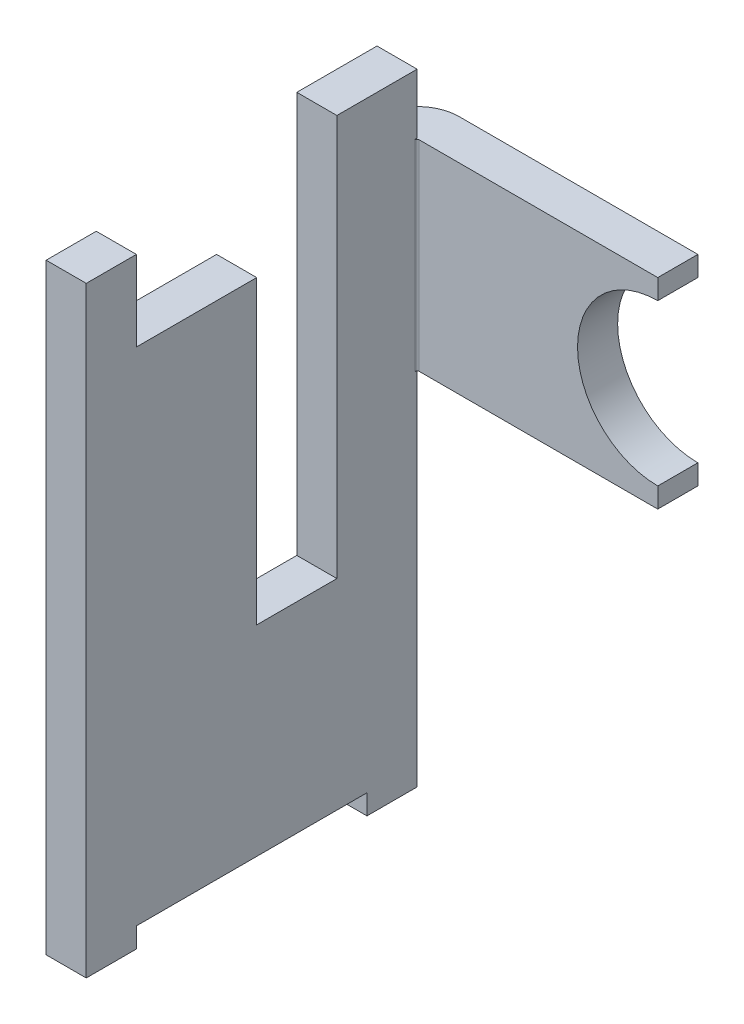
ISO-10303-21;
HEADER;
FILE_DESCRIPTION(('STEP AP214'),'2;1');
FILE_NAME('part.step','',(''),(''),'','','');
FILE_SCHEMA(('AUTOMOTIVE_DESIGN { 1 0 10303 214 1 1 1 1 }'));
ENDSEC;
DATA;
#1=APPLICATION_CONTEXT('core data for automotive mechanical design processes');
#2=APPLICATION_PROTOCOL_DEFINITION('international standard','automotive_design',2000,#1);
#3=PRODUCT_CONTEXT('',#1,'mechanical');
#4=PRODUCT('Part','Part','',(#3));
#5=PRODUCT_RELATED_PRODUCT_CATEGORY('part','',(#4));
#6=PRODUCT_DEFINITION_FORMATION('','',#4);
#7=PRODUCT_DEFINITION_CONTEXT('part definition',#1,'design');
#8=PRODUCT_DEFINITION('design','',#6,#7);
#9=PRODUCT_DEFINITION_SHAPE('','',#8);
#10=(LENGTH_UNIT() NAMED_UNIT(*) SI_UNIT(.MILLI.,.METRE.));
#11=(NAMED_UNIT(*) PLANE_ANGLE_UNIT() SI_UNIT($,.RADIAN.));
#12=(NAMED_UNIT(*) SI_UNIT($,.STERADIAN.) SOLID_ANGLE_UNIT());
#13=UNCERTAINTY_MEASURE_WITH_UNIT(LENGTH_MEASURE(1.E-05),#10,'distance_accuracy_value','');
#14=(GEOMETRIC_REPRESENTATION_CONTEXT(3) GLOBAL_UNCERTAINTY_ASSIGNED_CONTEXT((#13)) GLOBAL_UNIT_ASSIGNED_CONTEXT((#10,
#11,#12)) REPRESENTATION_CONTEXT('',''));
#15=CARTESIAN_POINT('',(0.,0.,0.));
#16=DIRECTION('',(0.,0.,1.));
#17=DIRECTION('',(1.,0.,0.));
#18=AXIS2_PLACEMENT_3D('',#15,#16,#17);
#19=CARTESIAN_POINT('',(1.2,1.25,-1.025));
#20=DIRECTION('',(-1.,0.,0.));
#21=DIRECTION('',(0.,0.,1.));
#22=AXIS2_PLACEMENT_3D('',#19,#20,#21);
#23=PLANE('',#22);
#24=DIRECTION('',(0.,1.,0.));
#25=VECTOR('',#24,1.);
#26=CARTESIAN_POINT('',(1.2,0.,-1.025));
#27=LINE('',#26,#25);
#28=CARTESIAN_POINT('',(1.2,1.25,-1.025));
#29=VERTEX_POINT('',#28);
#30=CARTESIAN_POINT('',(1.2,1.15,-1.025));
#31=VERTEX_POINT('',#30);
#32=EDGE_CURVE('E86',#29,#31,#27,.F.);
#33=ORIENTED_EDGE('',*,*,#32,.F.);
#34=DIRECTION('',(0.,0.,-1.));
#35=VECTOR('',#34,1.);
#36=CARTESIAN_POINT('',(1.2,1.25,-1.025));
#37=LINE('',#36,#35);
#38=CARTESIAN_POINT('',(1.2,1.25,-0.825));
#39=VERTEX_POINT('',#38);
#40=EDGE_CURVE('E123',#29,#39,#37,.F.);
#41=ORIENTED_EDGE('',*,*,#40,.T.);
#42=DIRECTION('',(0.,1.,0.));
#43=VECTOR('',#42,1.);
#44=CARTESIAN_POINT('',(1.2,0.,-0.825));
#45=LINE('',#44,#43);
#46=CARTESIAN_POINT('',(1.2,1.15,-0.825));
#47=VERTEX_POINT('',#46);
#48=EDGE_CURVE('E162',#39,#47,#45,.F.);
#49=ORIENTED_EDGE('',*,*,#48,.T.);
#50=DIRECTION('',(0.,0.,-1.));
#51=VECTOR('',#50,1.);
#52=CARTESIAN_POINT('',(1.2,1.15,-4.69701497931));
#53=LINE('',#52,#51);
#54=EDGE_CURVE('E105',#47,#31,#53,.T.);
#55=ORIENTED_EDGE('',*,*,#54,.T.);
#56=EDGE_LOOP('',(#33,#41,#49,#55));
#57=FACE_BOUND('',#56,.T.);
#58=ADVANCED_FACE('F17',(#57),#23,.F.);
#59=CARTESIAN_POINT('',(1.2,0.75,-4.69701497931));
#60=DIRECTION('',(0.,0.,-1.));
#61=DIRECTION('',(-1.,0.,0.));
#62=AXIS2_PLACEMENT_3D('',#59,#60,#61);
#63=CYLINDRICAL_SURFACE('',#62,0.4);
#64=DIRECTION('',(0.,0.,1.));
#65=VECTOR('',#64,1.);
#66=CARTESIAN_POINT('',(1.2,0.35,-1.025));
#67=LINE('',#66,#65);
#68=CARTESIAN_POINT('',(1.2,0.35,-0.825));
#69=VERTEX_POINT('',#68);
#70=CARTESIAN_POINT('',(1.2,0.35,-1.025));
#71=VERTEX_POINT('',#70);
#72=EDGE_CURVE('E98',#69,#71,#67,.F.);
#73=ORIENTED_EDGE('',*,*,#72,.T.);
#74=CARTESIAN_POINT('',(1.2,0.75,-1.025));
#75=DIRECTION('',(0.,0.,-1.));
#76=DIRECTION('',(-1.,0.,0.));
#77=AXIS2_PLACEMENT_3D('',#74,#75,#76);
#78=CIRCLE('',#77,0.4);
#79=EDGE_CURVE('E20',#31,#71,#78,.F.);
#80=ORIENTED_EDGE('',*,*,#79,.F.);
#81=ORIENTED_EDGE('',*,*,#54,.F.);
#82=CARTESIAN_POINT('',(1.2,0.75,-0.825));
#83=DIRECTION('',(0.,0.,-1.));
#84=DIRECTION('',(-1.,0.,0.));
#85=AXIS2_PLACEMENT_3D('',#82,#83,#84);
#86=CIRCLE('',#85,0.4);
#87=EDGE_CURVE('E101',#47,#69,#86,.F.);
#88=ORIENTED_EDGE('',*,*,#87,.T.);
#89=EDGE_LOOP('',(#73,#80,#81,#88));
#90=FACE_BOUND('',#89,.T.);
#91=ADVANCED_FACE('F99',(#90),#63,.F.);
#92=CARTESIAN_POINT('',(1.2,1.25,-1.025));
#93=DIRECTION('',(-1.,0.,0.));
#94=DIRECTION('',(0.,0.,1.));
#95=AXIS2_PLACEMENT_3D('',#92,#93,#94);
#96=PLANE('',#95);
#97=DIRECTION('',(0.,1.,0.));
#98=VECTOR('',#97,1.);
#99=CARTESIAN_POINT('',(1.2,0.,-0.825));
#100=LINE('',#99,#98);
#101=CARTESIAN_POINT('',(1.2,0.25,-0.825));
#102=VERTEX_POINT('',#101);
#103=EDGE_CURVE('E261',#69,#102,#100,.F.);
#104=ORIENTED_EDGE('',*,*,#103,.T.);
#105=DIRECTION('',(0.,0.,1.));
#106=VECTOR('',#105,1.);
#107=CARTESIAN_POINT('',(1.2,0.25,-1.025));
#108=LINE('',#107,#106);
#109=CARTESIAN_POINT('',(1.2,0.25,-1.025));
#110=VERTEX_POINT('',#109);
#111=EDGE_CURVE('E110',#102,#110,#108,.F.);
#112=ORIENTED_EDGE('',*,*,#111,.T.);
#113=DIRECTION('',(0.,1.,0.));
#114=VECTOR('',#113,1.);
#115=CARTESIAN_POINT('',(1.2,0.,-1.025));
#116=LINE('',#115,#114);
#117=EDGE_CURVE('E94',#71,#110,#116,.F.);
#118=ORIENTED_EDGE('',*,*,#117,.F.);
#119=ORIENTED_EDGE('',*,*,#72,.F.);
#120=EDGE_LOOP('',(#104,#112,#118,#119));
#121=FACE_BOUND('',#120,.T.);
#122=ADVANCED_FACE('F108',(#121),#96,.F.);
#123=CARTESIAN_POINT('',(0.,0.,-1.025));
#124=DIRECTION('',(0.,0.,-1.));
#125=DIRECTION('',(-1.,0.,0.));
#126=AXIS2_PLACEMENT_3D('',#123,#124,#125);
#127=PLANE('',#126);
#128=DIRECTION('',(0.,1.,0.));
#129=VECTOR('',#128,1.);
#130=CARTESIAN_POINT('',(0.01,1.25,-1.025));
#131=LINE('',#130,#129);
#132=CARTESIAN_POINT('',(0.01,1.25,-1.025));
#133=VERTEX_POINT('',#132);
#134=CARTESIAN_POINT('',(0.01,0.25,-1.025));
#135=VERTEX_POINT('',#134);
#136=EDGE_CURVE('E111',#133,#135,#131,.F.);
#137=ORIENTED_EDGE('',*,*,#136,.F.);
#138=DIRECTION('',(1.,0.,0.));
#139=VECTOR('',#138,1.);
#140=CARTESIAN_POINT('',(-0.04969026041821,1.25,-1.025));
#141=LINE('',#140,#139);
#142=EDGE_CURVE('E164',#133,#29,#141,.T.);
#143=ORIENTED_EDGE('',*,*,#142,.T.);
#144=ORIENTED_EDGE('',*,*,#32,.T.);
#145=ORIENTED_EDGE('',*,*,#79,.T.);
#146=ORIENTED_EDGE('',*,*,#117,.T.);
#147=DIRECTION('',(-1.,0.,0.));
#148=VECTOR('',#147,1.);
#149=CARTESIAN_POINT('',(-0.04969026041821,0.25,-1.025));
#150=LINE('',#149,#148);
#151=EDGE_CURVE('E160',#110,#135,#150,.T.);
#152=ORIENTED_EDGE('',*,*,#151,.T.);
#153=EDGE_LOOP('',(#137,#143,#144,#145,#146,#152));
#154=FACE_BOUND('',#153,.T.);
#155=ADVANCED_FACE('F91',(#154),#127,.T.);
#156=CARTESIAN_POINT('',(0.01,1.25,-0.815));
#157=DIRECTION('',(0.,1.,0.));
#158=DIRECTION('',(0.,0.,1.));
#159=AXIS2_PLACEMENT_3D('',#156,#157,#158);
#160=CYLINDRICAL_SURFACE('',#159,0.21);
#161=CARTESIAN_POINT('',(0.01,1.25,-0.815));
#162=DIRECTION('',(0.,1.,0.));
#163=DIRECTION('',(0.,0.,1.));
#164=AXIS2_PLACEMENT_3D('',#161,#162,#163);
#165=CIRCLE('',#164,0.21);
#166=CARTESIAN_POINT('',(-0.2,1.25,-0.815));
#167=VERTEX_POINT('',#166);
#168=EDGE_CURVE('E126',#167,#133,#165,.F.);
#169=ORIENTED_EDGE('',*,*,#168,.T.);
#170=ORIENTED_EDGE('',*,*,#136,.T.);
#171=CARTESIAN_POINT('',(0.01,0.25,-0.815));
#172=DIRECTION('',(0.,1.,0.));
#173=DIRECTION('',(0.,0.,1.));
#174=AXIS2_PLACEMENT_3D('',#171,#172,#173);
#175=CIRCLE('',#174,0.21);
#176=CARTESIAN_POINT('',(-0.2,0.25,-0.815));
#177=VERTEX_POINT('',#176);
#178=EDGE_CURVE('E156',#135,#177,#175,.T.);
#179=ORIENTED_EDGE('',*,*,#178,.T.);
#180=DIRECTION('',(0.,1.,0.));
#181=VECTOR('',#180,1.);
#182=CARTESIAN_POINT('',(-0.2,0.,-0.815));
#183=LINE('',#182,#181);
#184=EDGE_CURVE('E127',#167,#177,#183,.F.);
#185=ORIENTED_EDGE('',*,*,#184,.F.);
#186=EDGE_LOOP('',(#169,#170,#179,#185));
#187=FACE_BOUND('',#186,.T.);
#188=ADVANCED_FACE('F580',(#187),#160,.T.);
#189=CARTESIAN_POINT('',(-0.2,0.,0.));
#190=DIRECTION('',(-1.,0.,0.));
#191=DIRECTION('',(0.,0.,1.));
#192=AXIS2_PLACEMENT_3D('',#189,#190,#191);
#193=PLANE('',#192);
#194=DIRECTION('',(0.,1.,0.));
#195=VECTOR('',#194,1.);
#196=CARTESIAN_POINT('',(-0.2,0.,-0.815));
#197=LINE('',#196,#195);
#198=CARTESIAN_POINT('',(-0.2,1.252,-0.815));
#199=VERTEX_POINT('',#198);
#200=EDGE_CURVE('E130',#199,#167,#197,.F.);
#201=ORIENTED_EDGE('',*,*,#200,.T.);
#202=ORIENTED_EDGE('',*,*,#184,.T.);
#203=DIRECTION('',(0.,1.,0.));
#204=VECTOR('',#203,1.);
#205=CARTESIAN_POINT('',(-0.2,1.252,-0.815));
#206=LINE('',#205,#204);
#207=CARTESIAN_POINT('',(-0.2,0.248,-0.815));
#208=VERTEX_POINT('',#207);
#209=EDGE_CURVE('E113',#177,#208,#206,.F.);
#210=ORIENTED_EDGE('',*,*,#209,.T.);
#211=DIRECTION('',(0.,0.,1.));
#212=VECTOR('',#211,1.);
#213=CARTESIAN_POINT('',(-0.2,0.248,0.));
#214=LINE('',#213,#212);
#215=CARTESIAN_POINT('',(-0.2,0.248,-0.825));
#216=VERTEX_POINT('',#215);
#217=EDGE_CURVE('E165',#208,#216,#214,.F.);
#218=ORIENTED_EDGE('',*,*,#217,.T.);
#219=DIRECTION('',(0.,1.,0.));
#220=VECTOR('',#219,1.);
#221=CARTESIAN_POINT('',(-0.2,1.55,-0.825));
#222=LINE('',#221,#220);
#223=CARTESIAN_POINT('',(-0.2,-1.55,-0.825));
#224=VERTEX_POINT('',#223);
#225=EDGE_CURVE('E394',#216,#224,#222,.F.);
#226=ORIENTED_EDGE('',*,*,#225,.T.);
#227=DIRECTION('',(0.,0.,1.));
#228=VECTOR('',#227,1.);
#229=CARTESIAN_POINT('',(-0.2,-1.55,-0.825));
#230=LINE('',#229,#228);
#231=CARTESIAN_POINT('',(-0.2,-1.55,-0.575));
#232=VERTEX_POINT('',#231);
#233=EDGE_CURVE('E242',#224,#232,#230,.T.);
#234=ORIENTED_EDGE('',*,*,#233,.T.);
#235=DIRECTION('',(0.,1.,0.));
#236=VECTOR('',#235,1.);
#237=CARTESIAN_POINT('',(-0.2,-1.45,-0.575));
#238=LINE('',#237,#236);
#239=CARTESIAN_POINT('',(-0.2,-1.45,-0.575));
#240=VERTEX_POINT('',#239);
#241=EDGE_CURVE('E236',#240,#232,#238,.F.);
#242=ORIENTED_EDGE('',*,*,#241,.F.);
#243=DIRECTION('',(0.,0.,-1.));
#244=VECTOR('',#243,1.);
#245=CARTESIAN_POINT('',(-0.2,-1.45,0.575));
#246=LINE('',#245,#244);
#247=CARTESIAN_POINT('',(-0.2,-1.45,0.575));
#248=VERTEX_POINT('',#247);
#249=EDGE_CURVE('E230',#248,#240,#246,.T.);
#250=ORIENTED_EDGE('',*,*,#249,.F.);
#251=DIRECTION('',(0.,1.,0.));
#252=VECTOR('',#251,1.);
#253=CARTESIAN_POINT('',(-0.2,-1.55,0.575));
#254=LINE('',#253,#252);
#255=CARTESIAN_POINT('',(-0.2,-1.55,0.575));
#256=VERTEX_POINT('',#255);
#257=EDGE_CURVE('E224',#256,#248,#254,.T.);
#258=ORIENTED_EDGE('',*,*,#257,.F.);
#259=DIRECTION('',(0.,0.,1.));
#260=VECTOR('',#259,1.);
#261=CARTESIAN_POINT('',(-0.2,-1.55,-0.825));
#262=LINE('',#261,#260);
#263=CARTESIAN_POINT('',(-0.2,-1.55,0.825));
#264=VERTEX_POINT('',#263);
#265=EDGE_CURVE('E218',#256,#264,#262,.T.);
#266=ORIENTED_EDGE('',*,*,#265,.T.);
#267=DIRECTION('',(0.,1.,0.));
#268=VECTOR('',#267,1.);
#269=CARTESIAN_POINT('',(-0.2,-1.55,0.825));
#270=LINE('',#269,#268);
#271=CARTESIAN_POINT('',(-0.2,1.45,0.825));
#272=VERTEX_POINT('',#271);
#273=EDGE_CURVE('E212',#264,#272,#270,.T.);
#274=ORIENTED_EDGE('',*,*,#273,.T.);
#275=DIRECTION('',(0.,0.,-1.));
#276=VECTOR('',#275,1.);
#277=CARTESIAN_POINT('',(-0.2,1.45,0.825));
#278=LINE('',#277,#276);
#279=CARTESIAN_POINT('',(-0.2,1.45,0.575));
#280=VERTEX_POINT('',#279);
#281=EDGE_CURVE('E206',#272,#280,#278,.T.);
#282=ORIENTED_EDGE('',*,*,#281,.T.);
#283=DIRECTION('',(0.,1.,0.));
#284=VECTOR('',#283,1.);
#285=CARTESIAN_POINT('',(-0.2,1.45,0.575));
#286=LINE('',#285,#284);
#287=CARTESIAN_POINT('',(-0.2,1.05,0.575));
#288=VERTEX_POINT('',#287);
#289=EDGE_CURVE('E200',#280,#288,#286,.F.);
#290=ORIENTED_EDGE('',*,*,#289,.T.);
#291=DIRECTION('',(0.,0.,-1.));
#292=VECTOR('',#291,1.);
#293=CARTESIAN_POINT('',(-0.2,1.05,0.575));
#294=LINE('',#293,#292);
#295=CARTESIAN_POINT('',(-0.2,1.05,-0.025));
#296=VERTEX_POINT('',#295);
#297=EDGE_CURVE('E194',#288,#296,#294,.T.);
#298=ORIENTED_EDGE('',*,*,#297,.T.);
#299=DIRECTION('',(0.,-1.,0.));
#300=VECTOR('',#299,1.);
#301=CARTESIAN_POINT('',(-0.2,1.05,-0.025));
#302=LINE('',#301,#300);
#303=CARTESIAN_POINT('',(-0.2,-0.45,-0.025));
#304=VERTEX_POINT('',#303);
#305=EDGE_CURVE('E188',#296,#304,#302,.T.);
#306=ORIENTED_EDGE('',*,*,#305,.T.);
#307=DIRECTION('',(0.,0.,-1.));
#308=VECTOR('',#307,1.);
#309=CARTESIAN_POINT('',(-0.2,-0.45,-0.025));
#310=LINE('',#309,#308);
#311=CARTESIAN_POINT('',(-0.2,-0.45,-0.425));
#312=VERTEX_POINT('',#311);
#313=EDGE_CURVE('E181',#304,#312,#310,.T.);
#314=ORIENTED_EDGE('',*,*,#313,.T.);
#315=DIRECTION('',(0.,1.,0.));
#316=VECTOR('',#315,1.);
#317=CARTESIAN_POINT('',(-0.2,-0.45,-0.425));
#318=LINE('',#317,#316);
#319=CARTESIAN_POINT('',(-0.2,1.55,-0.425));
#320=VERTEX_POINT('',#319);
#321=EDGE_CURVE('E275',#312,#320,#318,.T.);
#322=ORIENTED_EDGE('',*,*,#321,.T.);
#323=DIRECTION('',(0.,0.,1.));
#324=VECTOR('',#323,1.);
#325=CARTESIAN_POINT('',(-0.2,1.55,0.));
#326=LINE('',#325,#324);
#327=CARTESIAN_POINT('',(-0.2,1.55,-0.825));
#328=VERTEX_POINT('',#327);
#329=EDGE_CURVE('E142',#320,#328,#326,.F.);
#330=ORIENTED_EDGE('',*,*,#329,.T.);
#331=DIRECTION('',(0.,1.,0.));
#332=VECTOR('',#331,1.);
#333=CARTESIAN_POINT('',(-0.2,0.,-0.825));
#334=LINE('',#333,#332);
#335=CARTESIAN_POINT('',(-0.2,1.252,-0.825));
#336=VERTEX_POINT('',#335);
#337=EDGE_CURVE('E137',#328,#336,#334,.F.);
#338=ORIENTED_EDGE('',*,*,#337,.T.);
#339=DIRECTION('',(0.,0.,1.));
#340=VECTOR('',#339,1.);
#341=CARTESIAN_POINT('',(-0.2,1.252,0.));
#342=LINE('',#341,#340);
#343=EDGE_CURVE('E132',#336,#199,#342,.T.);
#344=ORIENTED_EDGE('',*,*,#343,.T.);
#345=EDGE_LOOP('',(#201,#202,#210,#218,#226,#234,#242,#250,#258,#266,#274,#282,#290,#298,#306,
#314,#322,#330,#338,#344));
#346=FACE_BOUND('',#345,.T.);
#347=ADVANCED_FACE('F567',(#346),#193,.T.);
#348=CARTESIAN_POINT('',(-0.04969026041821,1.25,-1.025));
#349=DIRECTION('',(0.,-1.,0.));
#350=DIRECTION('',(0.,0.,-1.));
#351=AXIS2_PLACEMENT_3D('',#348,#349,#350);
#352=PLANE('',#351);
#353=ORIENTED_EDGE('',*,*,#168,.F.);
#354=DIRECTION('',(1.,0.,0.));
#355=VECTOR('',#354,1.);
#356=CARTESIAN_POINT('',(-0.2,1.25,-0.815));
#357=LINE('',#356,#355);
#358=CARTESIAN_POINT('',(0.,1.25,-0.815));
#359=VERTEX_POINT('',#358);
#360=EDGE_CURVE('E155',#167,#359,#357,.T.);
#361=ORIENTED_EDGE('',*,*,#360,.T.);
#362=CARTESIAN_POINT('',(0.01,1.25,-0.815));
#363=DIRECTION('',(0.,1.,0.));
#364=DIRECTION('',(0.,0.,1.));
#365=AXIS2_PLACEMENT_3D('',#362,#363,#364);
#366=CIRCLE('',#365,0.01);
#367=CARTESIAN_POINT('',(0.01,1.25,-0.825));
#368=VERTEX_POINT('',#367);
#369=EDGE_CURVE('E148',#359,#368,#366,.F.);
#370=ORIENTED_EDGE('',*,*,#369,.T.);
#371=DIRECTION('',(-1.,0.,0.));
#372=VECTOR('',#371,1.);
#373=CARTESIAN_POINT('',(0.,1.25,-0.825));
#374=LINE('',#373,#372);
#375=EDGE_CURVE('E258',#368,#39,#374,.F.);
#376=ORIENTED_EDGE('',*,*,#375,.T.);
#377=ORIENTED_EDGE('',*,*,#40,.F.);
#378=ORIENTED_EDGE('',*,*,#142,.F.);
#379=EDGE_LOOP('',(#353,#361,#370,#376,#377,#378));
#380=FACE_BOUND('',#379,.T.);
#381=ADVANCED_FACE('F801',(#380),#352,.F.);
#382=CARTESIAN_POINT('',(0.,0.,-0.825));
#383=DIRECTION('',(0.,0.,-1.));
#384=DIRECTION('',(-1.,0.,0.));
#385=AXIS2_PLACEMENT_3D('',#382,#383,#384);
#386=PLANE('',#385);
#387=ORIENTED_EDGE('',*,*,#48,.F.);
#388=ORIENTED_EDGE('',*,*,#375,.F.);
#389=DIRECTION('',(0.,1.,0.));
#390=VECTOR('',#389,1.);
#391=CARTESIAN_POINT('',(0.01,1.25,-0.825));
#392=LINE('',#391,#390);
#393=CARTESIAN_POINT('',(0.01,0.25,-0.825));
#394=VERTEX_POINT('',#393);
#395=EDGE_CURVE('E151',#368,#394,#392,.F.);
#396=ORIENTED_EDGE('',*,*,#395,.T.);
#397=DIRECTION('',(-1.,0.,0.));
#398=VECTOR('',#397,1.);
#399=CARTESIAN_POINT('',(-0.04969026041821,0.25,-0.825));
#400=LINE('',#399,#398);
#401=EDGE_CURVE('E159',#394,#102,#400,.F.);
#402=ORIENTED_EDGE('',*,*,#401,.T.);
#403=ORIENTED_EDGE('',*,*,#103,.F.);
#404=ORIENTED_EDGE('',*,*,#87,.F.);
#405=EDGE_LOOP('',(#387,#388,#396,#402,#403,#404));
#406=FACE_BOUND('',#405,.T.);
#407=ADVANCED_FACE('F402',(#406),#386,.F.);
#408=CARTESIAN_POINT('',(-0.04969026041821,0.25,-1.025));
#409=DIRECTION('',(0.,1.,0.));
#410=DIRECTION('',(-1.,0.,0.));
#411=AXIS2_PLACEMENT_3D('',#408,#409,#410);
#412=PLANE('',#411);
#413=CARTESIAN_POINT('',(0.01,0.25,-0.815));
#414=DIRECTION('',(0.,1.,0.));
#415=DIRECTION('',(0.,0.,1.));
#416=AXIS2_PLACEMENT_3D('',#413,#414,#415);
#417=CIRCLE('',#416,0.01);
#418=CARTESIAN_POINT('',(0.,0.25,-0.815));
#419=VERTEX_POINT('',#418);
#420=EDGE_CURVE('E152',#394,#419,#417,.T.);
#421=ORIENTED_EDGE('',*,*,#420,.T.);
#422=DIRECTION('',(1.,0.,0.));
#423=VECTOR('',#422,1.);
#424=CARTESIAN_POINT('',(-0.2,0.25,-0.815));
#425=LINE('',#424,#423);
#426=EDGE_CURVE('E270',#419,#177,#425,.F.);
#427=ORIENTED_EDGE('',*,*,#426,.T.);
#428=ORIENTED_EDGE('',*,*,#178,.F.);
#429=ORIENTED_EDGE('',*,*,#151,.F.);
#430=ORIENTED_EDGE('',*,*,#111,.F.);
#431=ORIENTED_EDGE('',*,*,#401,.F.);
#432=EDGE_LOOP('',(#421,#427,#428,#429,#430,#431));
#433=FACE_BOUND('',#432,.T.);
#434=ADVANCED_FACE('F407',(#433),#412,.F.);
#435=CARTESIAN_POINT('',(-0.2,1.55,-0.825));
#436=DIRECTION('',(0.,0.,1.));
#437=DIRECTION('',(1.,0.,0.));
#438=AXIS2_PLACEMENT_3D('',#435,#436,#437);
#439=PLANE('',#438);
#440=DIRECTION('',(1.,0.,0.));
#441=VECTOR('',#440,1.);
#442=CARTESIAN_POINT('',(-0.2,0.248,-0.825));
#443=LINE('',#442,#441);
#444=CARTESIAN_POINT('',(0.,0.248,-0.825));
#445=VERTEX_POINT('',#444);
#446=EDGE_CURVE('E426',#216,#445,#443,.T.);
#447=ORIENTED_EDGE('',*,*,#446,.T.);
#448=DIRECTION('',(0.,1.,0.));
#449=VECTOR('',#448,1.);
#450=CARTESIAN_POINT('',(0.,0.,-0.825));
#451=LINE('',#450,#449);
#452=CARTESIAN_POINT('',(0.,-1.55,-0.825));
#453=VERTEX_POINT('',#452);
#454=EDGE_CURVE('E389',#445,#453,#451,.F.);
#455=ORIENTED_EDGE('',*,*,#454,.T.);
#456=DIRECTION('',(1.,0.,0.));
#457=VECTOR('',#456,1.);
#458=CARTESIAN_POINT('',(-0.2,-1.55,-0.825));
#459=LINE('',#458,#457);
#460=EDGE_CURVE('E245',#453,#224,#459,.F.);
#461=ORIENTED_EDGE('',*,*,#460,.T.);
#462=ORIENTED_EDGE('',*,*,#225,.F.);
#463=EDGE_LOOP('',(#447,#455,#461,#462));
#464=FACE_BOUND('',#463,.T.);
#465=ADVANCED_FACE('F585',(#464),#439,.F.);
#466=CARTESIAN_POINT('',(-0.2,-1.55,-0.825));
#467=DIRECTION('',(0.,1.,0.));
#468=DIRECTION('',(0.,0.,1.));
#469=AXIS2_PLACEMENT_3D('',#466,#467,#468);
#470=PLANE('',#469);
#471=ORIENTED_EDGE('',*,*,#233,.F.);
#472=ORIENTED_EDGE('',*,*,#460,.F.);
#473=DIRECTION('',(0.,0.,1.));
#474=VECTOR('',#473,1.);
#475=CARTESIAN_POINT('',(0.,-1.55,0.));
#476=LINE('',#475,#474);
#477=CARTESIAN_POINT('',(0.,-1.55,-0.575));
#478=VERTEX_POINT('',#477);
#479=EDGE_CURVE('E380',#453,#478,#476,.T.);
#480=ORIENTED_EDGE('',*,*,#479,.T.);
#481=DIRECTION('',(1.,0.,0.));
#482=VECTOR('',#481,1.);
#483=CARTESIAN_POINT('',(-3.517456467392,-1.55,-0.575));
#484=LINE('',#483,#482);
#485=EDGE_CURVE('E239',#232,#478,#484,.T.);
#486=ORIENTED_EDGE('',*,*,#485,.F.);
#487=EDGE_LOOP('',(#471,#472,#480,#486));
#488=FACE_BOUND('',#487,.T.);
#489=ADVANCED_FACE('F589',(#488),#470,.F.);
#490=CARTESIAN_POINT('',(-3.517456467392,-1.45,-0.575));
#491=DIRECTION('',(0.,0.,1.));
#492=DIRECTION('',(1.,0.,0.));
#493=AXIS2_PLACEMENT_3D('',#490,#491,#492);
#494=PLANE('',#493);
#495=DIRECTION('',(1.,0.,0.));
#496=VECTOR('',#495,1.);
#497=CARTESIAN_POINT('',(-3.517456467392,-1.45,-0.575));
#498=LINE('',#497,#496);
#499=CARTESIAN_POINT('',(0.,-1.45,-0.575));
#500=VERTEX_POINT('',#499);
#501=EDGE_CURVE('E233',#240,#500,#498,.T.);
#502=ORIENTED_EDGE('',*,*,#501,.F.);
#503=ORIENTED_EDGE('',*,*,#241,.T.);
#504=ORIENTED_EDGE('',*,*,#485,.T.);
#505=DIRECTION('',(0.,1.,0.));
#506=VECTOR('',#505,1.);
#507=CARTESIAN_POINT('',(0.,0.,-0.575));
#508=LINE('',#507,#506);
#509=EDGE_CURVE('E371',#478,#500,#508,.T.);
#510=ORIENTED_EDGE('',*,*,#509,.T.);
#511=EDGE_LOOP('',(#502,#503,#504,#510));
#512=FACE_BOUND('',#511,.T.);
#513=ADVANCED_FACE('F593',(#512),#494,.T.);
#514=CARTESIAN_POINT('',(-3.517456467392,-1.45,0.575));
#515=DIRECTION('',(0.,-1.,0.));
#516=DIRECTION('',(0.,0.,-1.));
#517=AXIS2_PLACEMENT_3D('',#514,#515,#516);
#518=PLANE('',#517);
#519=DIRECTION('',(-1.,0.,0.));
#520=VECTOR('',#519,1.);
#521=CARTESIAN_POINT('',(-3.517456467392,-1.45,0.575));
#522=LINE('',#521,#520);
#523=CARTESIAN_POINT('',(0.,-1.45,0.575));
#524=VERTEX_POINT('',#523);
#525=EDGE_CURVE('E227',#248,#524,#522,.F.);
#526=ORIENTED_EDGE('',*,*,#525,.F.);
#527=ORIENTED_EDGE('',*,*,#249,.T.);
#528=ORIENTED_EDGE('',*,*,#501,.T.);
#529=DIRECTION('',(0.,0.,1.));
#530=VECTOR('',#529,1.);
#531=CARTESIAN_POINT('',(0.,-1.45,0.));
#532=LINE('',#531,#530);
#533=EDGE_CURVE('E362',#500,#524,#532,.T.);
#534=ORIENTED_EDGE('',*,*,#533,.T.);
#535=EDGE_LOOP('',(#526,#527,#528,#534));
#536=FACE_BOUND('',#535,.T.);
#537=ADVANCED_FACE('F599',(#536),#518,.T.);
#538=CARTESIAN_POINT('',(-3.517456467392,-1.55,0.575));
#539=DIRECTION('',(0.,0.,-1.));
#540=DIRECTION('',(-1.,0.,0.));
#541=AXIS2_PLACEMENT_3D('',#538,#539,#540);
#542=PLANE('',#541);
#543=DIRECTION('',(1.,0.,0.));
#544=VECTOR('',#543,1.);
#545=CARTESIAN_POINT('',(-0.2,-1.55,0.575));
#546=LINE('',#545,#544);
#547=CARTESIAN_POINT('',(0.,-1.55,0.575));
#548=VERTEX_POINT('',#547);
#549=EDGE_CURVE('E221',#548,#256,#546,.F.);
#550=ORIENTED_EDGE('',*,*,#549,.T.);
#551=ORIENTED_EDGE('',*,*,#257,.T.);
#552=ORIENTED_EDGE('',*,*,#525,.T.);
#553=DIRECTION('',(0.,1.,0.));
#554=VECTOR('',#553,1.);
#555=CARTESIAN_POINT('',(0.,0.,0.575));
#556=LINE('',#555,#554);
#557=EDGE_CURVE('E353',#524,#548,#556,.F.);
#558=ORIENTED_EDGE('',*,*,#557,.T.);
#559=EDGE_LOOP('',(#550,#551,#552,#558));
#560=FACE_BOUND('',#559,.T.);
#561=ADVANCED_FACE('F602',(#560),#542,.T.);
#562=CARTESIAN_POINT('',(-0.2,-1.55,-0.825));
#563=DIRECTION('',(0.,1.,0.));
#564=DIRECTION('',(0.,0.,1.));
#565=AXIS2_PLACEMENT_3D('',#562,#563,#564);
#566=PLANE('',#565);
#567=ORIENTED_EDGE('',*,*,#549,.F.);
#568=DIRECTION('',(0.,0.,1.));
#569=VECTOR('',#568,1.);
#570=CARTESIAN_POINT('',(0.,-1.55,0.));
#571=LINE('',#570,#569);
#572=CARTESIAN_POINT('',(0.,-1.55,0.825));
#573=VERTEX_POINT('',#572);
#574=EDGE_CURVE('E344',#548,#573,#571,.T.);
#575=ORIENTED_EDGE('',*,*,#574,.T.);
#576=DIRECTION('',(1.,0.,0.));
#577=VECTOR('',#576,1.);
#578=CARTESIAN_POINT('',(-0.2,-1.55,0.825));
#579=LINE('',#578,#577);
#580=EDGE_CURVE('E215',#573,#264,#579,.F.);
#581=ORIENTED_EDGE('',*,*,#580,.T.);
#582=ORIENTED_EDGE('',*,*,#265,.F.);
#583=EDGE_LOOP('',(#567,#575,#581,#582));
#584=FACE_BOUND('',#583,.T.);
#585=ADVANCED_FACE('F604',(#584),#566,.F.);
#586=CARTESIAN_POINT('',(-0.2,-1.55,0.825));
#587=DIRECTION('',(0.,0.,-1.));
#588=DIRECTION('',(0.,1.,0.));
#589=AXIS2_PLACEMENT_3D('',#586,#587,#588);
#590=PLANE('',#589);
#591=DIRECTION('',(1.,0.,0.));
#592=VECTOR('',#591,1.);
#593=CARTESIAN_POINT('',(-0.2,1.45,0.825));
#594=LINE('',#593,#592);
#595=CARTESIAN_POINT('',(0.,1.45,0.825));
#596=VERTEX_POINT('',#595);
#597=EDGE_CURVE('E209',#596,#272,#594,.F.);
#598=ORIENTED_EDGE('',*,*,#597,.T.);
#599=ORIENTED_EDGE('',*,*,#273,.F.);
#600=ORIENTED_EDGE('',*,*,#580,.F.);
#601=DIRECTION('',(0.,1.,0.));
#602=VECTOR('',#601,1.);
#603=CARTESIAN_POINT('',(0.,0.,0.825));
#604=LINE('',#603,#602);
#605=EDGE_CURVE('E335',#573,#596,#604,.T.);
#606=ORIENTED_EDGE('',*,*,#605,.T.);
#607=EDGE_LOOP('',(#598,#599,#600,#606));
#608=FACE_BOUND('',#607,.T.);
#609=ADVANCED_FACE('F609',(#608),#590,.F.);
#610=CARTESIAN_POINT('',(-0.2,1.45,0.825));
#611=DIRECTION('',(0.,-1.,0.));
#612=DIRECTION('',(0.,0.,-1.));
#613=AXIS2_PLACEMENT_3D('',#610,#611,#612);
#614=PLANE('',#613);
#615=DIRECTION('',(1.,0.,0.));
#616=VECTOR('',#615,1.);
#617=CARTESIAN_POINT('',(-0.2,1.45,0.575));
#618=LINE('',#617,#616);
#619=CARTESIAN_POINT('',(0.,1.45,0.575));
#620=VERTEX_POINT('',#619);
#621=EDGE_CURVE('E203',#620,#280,#618,.F.);
#622=ORIENTED_EDGE('',*,*,#621,.T.);
#623=ORIENTED_EDGE('',*,*,#281,.F.);
#624=ORIENTED_EDGE('',*,*,#597,.F.);
#625=DIRECTION('',(0.,0.,1.));
#626=VECTOR('',#625,1.);
#627=CARTESIAN_POINT('',(0.,1.45,0.));
#628=LINE('',#627,#626);
#629=EDGE_CURVE('E326',#596,#620,#628,.F.);
#630=ORIENTED_EDGE('',*,*,#629,.T.);
#631=EDGE_LOOP('',(#622,#623,#624,#630));
#632=FACE_BOUND('',#631,.T.);
#633=ADVANCED_FACE('F614',(#632),#614,.F.);
#634=CARTESIAN_POINT('',(-0.2,1.45,0.575));
#635=DIRECTION('',(0.,0.,1.));
#636=DIRECTION('',(1.,0.,0.));
#637=AXIS2_PLACEMENT_3D('',#634,#635,#636);
#638=PLANE('',#637);
#639=DIRECTION('',(1.,0.,0.));
#640=VECTOR('',#639,1.);
#641=CARTESIAN_POINT('',(-0.2,1.05,0.575));
#642=LINE('',#641,#640);
#643=CARTESIAN_POINT('',(0.,1.05,0.575));
#644=VERTEX_POINT('',#643);
#645=EDGE_CURVE('E197',#644,#288,#642,.F.);
#646=ORIENTED_EDGE('',*,*,#645,.T.);
#647=ORIENTED_EDGE('',*,*,#289,.F.);
#648=ORIENTED_EDGE('',*,*,#621,.F.);
#649=DIRECTION('',(0.,1.,0.));
#650=VECTOR('',#649,1.);
#651=CARTESIAN_POINT('',(0.,0.,0.575));
#652=LINE('',#651,#650);
#653=EDGE_CURVE('E317',#620,#644,#652,.F.);
#654=ORIENTED_EDGE('',*,*,#653,.T.);
#655=EDGE_LOOP('',(#646,#647,#648,#654));
#656=FACE_BOUND('',#655,.T.);
#657=ADVANCED_FACE('F616',(#656),#638,.F.);
#658=CARTESIAN_POINT('',(-0.2,1.05,0.575));
#659=DIRECTION('',(0.,-1.,0.));
#660=DIRECTION('',(0.,0.,-1.));
#661=AXIS2_PLACEMENT_3D('',#658,#659,#660);
#662=PLANE('',#661);
#663=DIRECTION('',(1.,0.,0.));
#664=VECTOR('',#663,1.);
#665=CARTESIAN_POINT('',(-0.2,1.05,-0.025));
#666=LINE('',#665,#664);
#667=CARTESIAN_POINT('',(0.,1.05,-0.025));
#668=VERTEX_POINT('',#667);
#669=EDGE_CURVE('E191',#668,#296,#666,.F.);
#670=ORIENTED_EDGE('',*,*,#669,.T.);
#671=ORIENTED_EDGE('',*,*,#297,.F.);
#672=ORIENTED_EDGE('',*,*,#645,.F.);
#673=DIRECTION('',(0.,0.,1.));
#674=VECTOR('',#673,1.);
#675=CARTESIAN_POINT('',(0.,1.05,0.));
#676=LINE('',#675,#674);
#677=EDGE_CURVE('E308',#644,#668,#676,.F.);
#678=ORIENTED_EDGE('',*,*,#677,.T.);
#679=EDGE_LOOP('',(#670,#671,#672,#678));
#680=FACE_BOUND('',#679,.T.);
#681=ADVANCED_FACE('F619',(#680),#662,.F.);
#682=CARTESIAN_POINT('',(-0.2,1.05,-0.025));
#683=DIRECTION('',(0.,0.,1.));
#684=DIRECTION('',(0.,-1.,0.));
#685=AXIS2_PLACEMENT_3D('',#682,#683,#684);
#686=PLANE('',#685);
#687=DIRECTION('',(1.,0.,0.));
#688=VECTOR('',#687,1.);
#689=CARTESIAN_POINT('',(-0.2,-0.45,-0.025));
#690=LINE('',#689,#688);
#691=CARTESIAN_POINT('',(0.,-0.45,-0.025));
#692=VERTEX_POINT('',#691);
#693=EDGE_CURVE('E185',#692,#304,#690,.F.);
#694=ORIENTED_EDGE('',*,*,#693,.T.);
#695=ORIENTED_EDGE('',*,*,#305,.F.);
#696=ORIENTED_EDGE('',*,*,#669,.F.);
#697=DIRECTION('',(0.,1.,0.));
#698=VECTOR('',#697,1.);
#699=CARTESIAN_POINT('',(0.,0.,-0.025));
#700=LINE('',#699,#698);
#701=EDGE_CURVE('E299',#668,#692,#700,.F.);
#702=ORIENTED_EDGE('',*,*,#701,.T.);
#703=EDGE_LOOP('',(#694,#695,#696,#702));
#704=FACE_BOUND('',#703,.T.);
#705=ADVANCED_FACE('F491',(#704),#686,.F.);
#706=CARTESIAN_POINT('',(-0.2,-0.45,-0.025));
#707=DIRECTION('',(0.,-1.,0.));
#708=DIRECTION('',(0.,0.,-1.));
#709=AXIS2_PLACEMENT_3D('',#706,#707,#708);
#710=PLANE('',#709);
#711=DIRECTION('',(1.,0.,0.));
#712=VECTOR('',#711,1.);
#713=CARTESIAN_POINT('',(-0.2,-0.45,-0.425));
#714=LINE('',#713,#712);
#715=CARTESIAN_POINT('',(0.,-0.45,-0.425));
#716=VERTEX_POINT('',#715);
#717=EDGE_CURVE('E184',#716,#312,#714,.F.);
#718=ORIENTED_EDGE('',*,*,#717,.T.);
#719=ORIENTED_EDGE('',*,*,#313,.F.);
#720=ORIENTED_EDGE('',*,*,#693,.F.);
#721=DIRECTION('',(0.,0.,1.));
#722=VECTOR('',#721,1.);
#723=CARTESIAN_POINT('',(0.,-0.45,0.));
#724=LINE('',#723,#722);
#725=EDGE_CURVE('E296',#692,#716,#724,.F.);
#726=ORIENTED_EDGE('',*,*,#725,.T.);
#727=EDGE_LOOP('',(#718,#719,#720,#726));
#728=FACE_BOUND('',#727,.T.);
#729=ADVANCED_FACE('F485',(#728),#710,.F.);
#730=CARTESIAN_POINT('',(-0.2,-0.45,-0.425));
#731=DIRECTION('',(0.,0.,-1.));
#732=DIRECTION('',(0.,1.,0.));
#733=AXIS2_PLACEMENT_3D('',#730,#731,#732);
#734=PLANE('',#733);
#735=DIRECTION('',(1.,0.,0.));
#736=VECTOR('',#735,1.);
#737=CARTESIAN_POINT('',(-0.2,1.55,-0.425));
#738=LINE('',#737,#736);
#739=CARTESIAN_POINT('',(0.,1.55,-0.425));
#740=VERTEX_POINT('',#739);
#741=EDGE_CURVE('E277',#740,#320,#738,.F.);
#742=ORIENTED_EDGE('',*,*,#741,.T.);
#743=ORIENTED_EDGE('',*,*,#321,.F.);
#744=ORIENTED_EDGE('',*,*,#717,.F.);
#745=DIRECTION('',(0.,1.,0.));
#746=VECTOR('',#745,1.);
#747=CARTESIAN_POINT('',(0.,0.,-0.425));
#748=LINE('',#747,#746);
#749=EDGE_CURVE('E298',#716,#740,#748,.T.);
#750=ORIENTED_EDGE('',*,*,#749,.T.);
#751=EDGE_LOOP('',(#742,#743,#744,#750));
#752=FACE_BOUND('',#751,.T.);
#753=ADVANCED_FACE('F472',(#752),#734,.F.);
#754=CARTESIAN_POINT('',(-0.2,1.55,-0.425));
#755=DIRECTION('',(0.,-1.,0.));
#756=DIRECTION('',(0.,0.,-1.));
#757=AXIS2_PLACEMENT_3D('',#754,#755,#756);
#758=PLANE('',#757);
#759=DIRECTION('',(1.,0.,0.));
#760=VECTOR('',#759,1.);
#761=CARTESIAN_POINT('',(-0.2,1.55,-0.825));
#762=LINE('',#761,#760);
#763=CARTESIAN_POINT('',(0.,1.55,-0.825));
#764=VERTEX_POINT('',#763);
#765=EDGE_CURVE('E281',#764,#328,#762,.F.);
#766=ORIENTED_EDGE('',*,*,#765,.T.);
#767=ORIENTED_EDGE('',*,*,#329,.F.);
#768=ORIENTED_EDGE('',*,*,#741,.F.);
#769=DIRECTION('',(0.,0.,1.));
#770=VECTOR('',#769,1.);
#771=CARTESIAN_POINT('',(0.,1.55,0.));
#772=LINE('',#771,#770);
#773=EDGE_CURVE('E456',#740,#764,#772,.F.);
#774=ORIENTED_EDGE('',*,*,#773,.T.);
#775=EDGE_LOOP('',(#766,#767,#768,#774));
#776=FACE_BOUND('',#775,.T.);
#777=ADVANCED_FACE('F566',(#776),#758,.F.);
#778=CARTESIAN_POINT('',(-0.2,1.55,-0.825));
#779=DIRECTION('',(0.,0.,1.));
#780=DIRECTION('',(1.,0.,0.));
#781=AXIS2_PLACEMENT_3D('',#778,#779,#780);
#782=PLANE('',#781);
#783=DIRECTION('',(1.,0.,0.));
#784=VECTOR('',#783,1.);
#785=CARTESIAN_POINT('',(-0.2,1.252,-0.825));
#786=LINE('',#785,#784);
#787=CARTESIAN_POINT('',(0.,1.252,-0.825));
#788=VERTEX_POINT('',#787);
#789=EDGE_CURVE('E442',#788,#336,#786,.F.);
#790=ORIENTED_EDGE('',*,*,#789,.T.);
#791=ORIENTED_EDGE('',*,*,#337,.F.);
#792=ORIENTED_EDGE('',*,*,#765,.F.);
#793=DIRECTION('',(0.,1.,0.));
#794=VECTOR('',#793,1.);
#795=CARTESIAN_POINT('',(0.,0.,-0.825));
#796=LINE('',#795,#794);
#797=EDGE_CURVE('E447',#764,#788,#796,.F.);
#798=ORIENTED_EDGE('',*,*,#797,.T.);
#799=EDGE_LOOP('',(#790,#791,#792,#798));
#800=FACE_BOUND('',#799,.T.);
#801=ADVANCED_FACE('F563',(#800),#782,.F.);
#802=CARTESIAN_POINT('',(-0.2,1.252,-0.825));
#803=DIRECTION('',(0.,1.,0.));
#804=DIRECTION('',(0.,0.,1.));
#805=AXIS2_PLACEMENT_3D('',#802,#803,#804);
#806=PLANE('',#805);
#807=ORIENTED_EDGE('',*,*,#343,.F.);
#808=ORIENTED_EDGE('',*,*,#789,.F.);
#809=DIRECTION('',(0.,0.,1.));
#810=VECTOR('',#809,1.);
#811=CARTESIAN_POINT('',(0.,1.252,0.));
#812=LINE('',#811,#810);
#813=CARTESIAN_POINT('',(0.,1.252,-0.815));
#814=VERTEX_POINT('',#813);
#815=EDGE_CURVE('E420',#788,#814,#812,.T.);
#816=ORIENTED_EDGE('',*,*,#815,.T.);
#817=DIRECTION('',(1.,0.,0.));
#818=VECTOR('',#817,1.);
#819=CARTESIAN_POINT('',(-0.2,1.252,-0.815));
#820=LINE('',#819,#818);
#821=EDGE_CURVE('E439',#814,#199,#820,.F.);
#822=ORIENTED_EDGE('',*,*,#821,.T.);
#823=EDGE_LOOP('',(#807,#808,#816,#822));
#824=FACE_BOUND('',#823,.T.);
#825=ADVANCED_FACE('F570',(#824),#806,.F.);
#826=CARTESIAN_POINT('',(-0.2,1.252,-0.815));
#827=DIRECTION('',(0.,0.,1.));
#828=DIRECTION('',(1.,0.,0.));
#829=AXIS2_PLACEMENT_3D('',#826,#827,#828);
#830=PLANE('',#829);
#831=ORIENTED_EDGE('',*,*,#200,.F.);
#832=ORIENTED_EDGE('',*,*,#821,.F.);
#833=DIRECTION('',(0.,1.,0.));
#834=VECTOR('',#833,1.);
#835=CARTESIAN_POINT('',(0.,0.,-0.815));
#836=LINE('',#835,#834);
#837=EDGE_CURVE('E418',#814,#359,#836,.F.);
#838=ORIENTED_EDGE('',*,*,#837,.T.);
#839=ORIENTED_EDGE('',*,*,#360,.F.);
#840=EDGE_LOOP('',(#831,#832,#838,#839));
#841=FACE_BOUND('',#840,.T.);
#842=ADVANCED_FACE('F574',(#841),#830,.F.);
#843=CARTESIAN_POINT('',(0.01,1.25,-0.815));
#844=DIRECTION('',(0.,1.,0.));
#845=DIRECTION('',(0.,0.,1.));
#846=AXIS2_PLACEMENT_3D('',#843,#844,#845);
#847=CYLINDRICAL_SURFACE('',#846,0.01);
#848=ORIENTED_EDGE('',*,*,#369,.F.);
#849=DIRECTION('',(0.,1.,0.));
#850=VECTOR('',#849,1.);
#851=CARTESIAN_POINT('',(0.,0.,-0.815));
#852=LINE('',#851,#850);
#853=EDGE_CURVE('E147',#359,#419,#852,.F.);
#854=ORIENTED_EDGE('',*,*,#853,.T.);
#855=ORIENTED_EDGE('',*,*,#420,.F.);
#856=ORIENTED_EDGE('',*,*,#395,.F.);
#857=EDGE_LOOP('',(#848,#854,#855,#856));
#858=FACE_BOUND('',#857,.T.);
#859=ADVANCED_FACE('F412',(#858),#847,.F.);
#860=CARTESIAN_POINT('',(-0.2,1.252,-0.815));
#861=DIRECTION('',(0.,0.,1.));
#862=DIRECTION('',(1.,0.,0.));
#863=AXIS2_PLACEMENT_3D('',#860,#861,#862);
#864=PLANE('',#863);
#865=DIRECTION('',(0.,1.,0.));
#866=VECTOR('',#865,1.);
#867=CARTESIAN_POINT('',(0.,1.252,-0.815));
#868=LINE('',#867,#866);
#869=CARTESIAN_POINT('',(0.,0.248,-0.815));
#870=VERTEX_POINT('',#869);
#871=EDGE_CURVE('E26',#419,#870,#868,.F.);
#872=ORIENTED_EDGE('',*,*,#871,.T.);
#873=DIRECTION('',(1.,0.,0.));
#874=VECTOR('',#873,1.);
#875=CARTESIAN_POINT('',(-0.2,0.248,-0.815));
#876=LINE('',#875,#874);
#877=EDGE_CURVE('E34',#870,#208,#876,.F.);
#878=ORIENTED_EDGE('',*,*,#877,.T.);
#879=ORIENTED_EDGE('',*,*,#209,.F.);
#880=ORIENTED_EDGE('',*,*,#426,.F.);
#881=EDGE_LOOP('',(#872,#878,#879,#880));
#882=FACE_BOUND('',#881,.T.);
#883=ADVANCED_FACE('F581',(#882),#864,.F.);
#884=CARTESIAN_POINT('',(-0.2,0.248,-0.825));
#885=DIRECTION('',(0.,-1.,0.));
#886=DIRECTION('',(0.,0.,-1.));
#887=AXIS2_PLACEMENT_3D('',#884,#885,#886);
#888=PLANE('',#887);
#889=ORIENTED_EDGE('',*,*,#217,.F.);
#890=ORIENTED_EDGE('',*,*,#877,.F.);
#891=DIRECTION('',(0.,0.,1.));
#892=VECTOR('',#891,1.);
#893=CARTESIAN_POINT('',(0.,0.248,0.));
#894=LINE('',#893,#892);
#895=EDGE_CURVE('E11',#870,#445,#894,.F.);
#896=ORIENTED_EDGE('',*,*,#895,.T.);
#897=ORIENTED_EDGE('',*,*,#446,.F.);
#898=EDGE_LOOP('',(#889,#890,#896,#897));
#899=FACE_BOUND('',#898,.T.);
#900=ADVANCED_FACE('F583',(#899),#888,.F.);
#901=CARTESIAN_POINT('',(0.,0.,0.));
#902=DIRECTION('',(-1.,0.,0.));
#903=DIRECTION('',(0.,0.,1.));
#904=AXIS2_PLACEMENT_3D('',#901,#902,#903);
#905=PLANE('',#904);
#906=ORIENTED_EDGE('',*,*,#871,.F.);
#907=ORIENTED_EDGE('',*,*,#853,.F.);
#908=ORIENTED_EDGE('',*,*,#837,.F.);
#909=ORIENTED_EDGE('',*,*,#815,.F.);
#910=ORIENTED_EDGE('',*,*,#797,.F.);
#911=ORIENTED_EDGE('',*,*,#773,.F.);
#912=ORIENTED_EDGE('',*,*,#749,.F.);
#913=ORIENTED_EDGE('',*,*,#725,.F.);
#914=ORIENTED_EDGE('',*,*,#701,.F.);
#915=ORIENTED_EDGE('',*,*,#677,.F.);
#916=ORIENTED_EDGE('',*,*,#653,.F.);
#917=ORIENTED_EDGE('',*,*,#629,.F.);
#918=ORIENTED_EDGE('',*,*,#605,.F.);
#919=ORIENTED_EDGE('',*,*,#574,.F.);
#920=ORIENTED_EDGE('',*,*,#557,.F.);
#921=ORIENTED_EDGE('',*,*,#533,.F.);
#922=ORIENTED_EDGE('',*,*,#509,.F.);
#923=ORIENTED_EDGE('',*,*,#479,.F.);
#924=ORIENTED_EDGE('',*,*,#454,.F.);
#925=ORIENTED_EDGE('',*,*,#895,.F.);
#926=EDGE_LOOP('',(#906,#907,#908,#909,#910,#911,#912,#913,#914,#915,#916,#917,#918,#919,#920,
#921,#922,#923,#924,#925));
#927=FACE_BOUND('',#926,.T.);
#928=ADVANCED_FACE('F479',(#927),#905,.F.);
#929=CLOSED_SHELL('',(#58,#91,#122,#155,#188,#347,#381,#407,#434,#465,#489,#513,#537,#561,#585,
#609,#633,#657,#681,#705,#729,#753,#777,#801,#825,#842,#859,#883,#900,#928));
#930=MANIFOLD_SOLID_BREP('B1',#929);
#931=ADVANCED_BREP_SHAPE_REPRESENTATION('',(#18,#930),#14);
#932=SHAPE_DEFINITION_REPRESENTATION(#9,#931);
ENDSEC;
END-ISO-10303-21;
